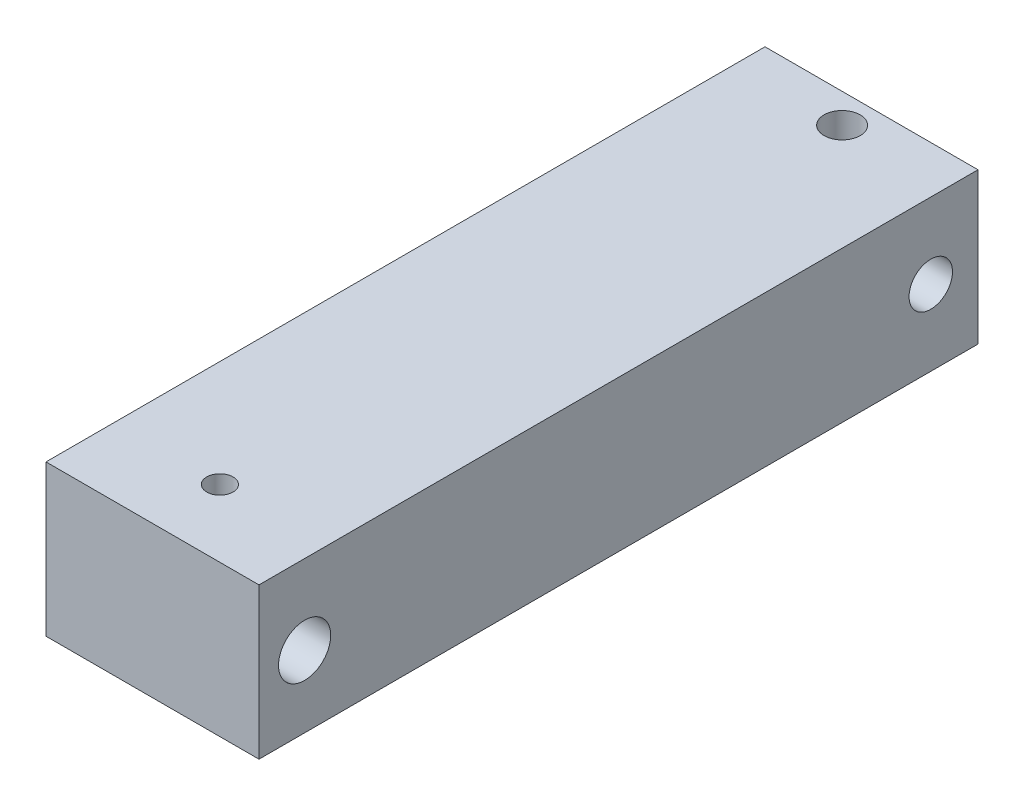
ISO-10303-21;
HEADER;
FILE_DESCRIPTION(('STEP AP214'),'2;1');
FILE_NAME('part.step','',(''),(''),'','','');
FILE_SCHEMA(('AUTOMOTIVE_DESIGN { 1 0 10303 214 1 1 1 1 }'));
ENDSEC;
DATA;
#1=APPLICATION_CONTEXT('core data for automotive mechanical design processes');
#2=APPLICATION_PROTOCOL_DEFINITION('international standard','automotive_design',2000,#1);
#3=PRODUCT_CONTEXT('',#1,'mechanical');
#4=PRODUCT('Part','Part','',(#3));
#5=PRODUCT_RELATED_PRODUCT_CATEGORY('part','',(#4));
#6=PRODUCT_DEFINITION_FORMATION('','',#4);
#7=PRODUCT_DEFINITION_CONTEXT('part definition',#1,'design');
#8=PRODUCT_DEFINITION('design','',#6,#7);
#9=PRODUCT_DEFINITION_SHAPE('','',#8);
#10=(LENGTH_UNIT() NAMED_UNIT(*) SI_UNIT(.MILLI.,.METRE.));
#11=(NAMED_UNIT(*) PLANE_ANGLE_UNIT() SI_UNIT($,.RADIAN.));
#12=(NAMED_UNIT(*) SI_UNIT($,.STERADIAN.) SOLID_ANGLE_UNIT());
#13=UNCERTAINTY_MEASURE_WITH_UNIT(LENGTH_MEASURE(1.E-05),#10,'distance_accuracy_value','');
#14=(GEOMETRIC_REPRESENTATION_CONTEXT(3) GLOBAL_UNCERTAINTY_ASSIGNED_CONTEXT((#13)) GLOBAL_UNIT_ASSIGNED_CONTEXT((#10,
#11,#12)) REPRESENTATION_CONTEXT('',''));
#15=CARTESIAN_POINT('',(0.,0.,0.));
#16=DIRECTION('',(0.,0.,1.));
#17=DIRECTION('',(1.,0.,0.));
#18=AXIS2_PLACEMENT_3D('',#15,#16,#17);
#19=CARTESIAN_POINT('',(0.,0.,117.));
#20=DIRECTION('',(1.,0.,0.));
#21=DIRECTION('',(0.,0.,-1.));
#22=AXIS2_PLACEMENT_3D('',#19,#20,#21);
#23=PLANE('',#22);
#24=CARTESIAN_POINT('',(0.,12.2852131549906,7.68541243555776));
#25=DIRECTION('',(1.,0.,0.));
#26=DIRECTION('',(0.,0.,-1.));
#27=AXIS2_PLACEMENT_3D('',#24,#25,#26);
#28=CIRCLE('',#27,3.53272884831822);
#29=CARTESIAN_POINT('',(0.,12.2852131549906,4.15268358723954));
#30=VERTEX_POINT('',#29);
#31=EDGE_CURVE('E170',#30,#30,#28,.T.);
#32=ORIENTED_EDGE('',*,*,#31,.T.);
#33=EDGE_LOOP('',(#32));
#34=FACE_BOUND('',#33,.T.);
#35=CARTESIAN_POINT('',(0.,11.6331867961656,109.575398107972));
#36=DIRECTION('',(-1.,0.,0.));
#37=DIRECTION('',(0.,0.,1.));
#38=AXIS2_PLACEMENT_3D('',#35,#36,#37);
#39=CIRCLE('',#38,4.24212622823838);
#40=CARTESIAN_POINT('',(0.,11.6331867961656,113.817524336211));
#41=VERTEX_POINT('',#40);
#42=EDGE_CURVE('E137',#41,#41,#39,.T.);
#43=ORIENTED_EDGE('',*,*,#42,.F.);
#44=EDGE_LOOP('',(#43));
#45=FACE_BOUND('',#44,.T.);
#46=DIRECTION('',(0.,-1.,0.));
#47=VECTOR('',#46,1.);
#48=CARTESIAN_POINT('',(0.,0.,0.));
#49=LINE('',#48,#47);
#50=CARTESIAN_POINT('',(0.,24.5704263099813,0.));
#51=VERTEX_POINT('',#50);
#52=CARTESIAN_POINT('',(0.,0.,0.));
#53=VERTEX_POINT('',#52);
#54=EDGE_CURVE('E114',#51,#53,#49,.T.);
#55=ORIENTED_EDGE('',*,*,#54,.T.);
#56=DIRECTION('',(0.,0.,-1.));
#57=VECTOR('',#56,1.);
#58=CARTESIAN_POINT('',(0.,0.,117.));
#59=LINE('',#58,#57);
#60=CARTESIAN_POINT('',(0.,0.,117.));
#61=VERTEX_POINT('',#60);
#62=EDGE_CURVE('E11',#61,#53,#59,.T.);
#63=ORIENTED_EDGE('',*,*,#62,.F.);
#64=DIRECTION('',(0.,-1.,0.));
#65=VECTOR('',#64,1.);
#66=CARTESIAN_POINT('',(0.,0.,117.));
#67=LINE('',#66,#65);
#68=CARTESIAN_POINT('',(0.,24.5704263099813,117.));
#69=VERTEX_POINT('',#68);
#70=EDGE_CURVE('E97',#69,#61,#67,.T.);
#71=ORIENTED_EDGE('',*,*,#70,.F.);
#72=DIRECTION('',(0.,0.,-1.));
#73=VECTOR('',#72,1.);
#74=CARTESIAN_POINT('',(0.,24.5704263099813,117.));
#75=LINE('',#74,#73);
#76=EDGE_CURVE('E110',#69,#51,#75,.T.);
#77=ORIENTED_EDGE('',*,*,#76,.T.);
#78=EDGE_LOOP('',(#55,#63,#71,#77));
#79=FACE_BOUND('',#78,.T.);
#80=ADVANCED_FACE('F38',(#34,#45,#79),#23,.F.);
#81=CARTESIAN_POINT('',(0.,0.,117.));
#82=DIRECTION('',(0.,1.,0.));
#83=DIRECTION('',(0.,0.,1.));
#84=AXIS2_PLACEMENT_3D('',#81,#82,#83);
#85=PLANE('',#84);
#86=CARTESIAN_POINT('',(17.3300915608423,0.,4.7781419650313));
#87=DIRECTION('',(0.,1.,0.));
#88=DIRECTION('',(0.,0.,1.));
#89=AXIS2_PLACEMENT_3D('',#86,#87,#88);
#90=CIRCLE('',#89,2.93650609483379);
#91=CARTESIAN_POINT('',(17.3300915608423,0.,7.71464805986509));
#92=VERTEX_POINT('',#91);
#93=EDGE_CURVE('E118',#92,#92,#90,.T.);
#94=ORIENTED_EDGE('',*,*,#93,.T.);
#95=EDGE_LOOP('',(#94));
#96=FACE_BOUND('',#95,.T.);
#97=CARTESIAN_POINT('',(17.3300915608423,0.,106.034000041412));
#98=DIRECTION('',(0.,1.,0.));
#99=DIRECTION('',(0.,0.,1.));
#100=AXIS2_PLACEMENT_3D('',#97,#98,#99);
#101=CIRCLE('',#100,2.13836371680032);
#102=CARTESIAN_POINT('',(17.3300915608423,0.,108.172363758212));
#103=VERTEX_POINT('',#102);
#104=EDGE_CURVE('E209',#103,#103,#101,.T.);
#105=ORIENTED_EDGE('',*,*,#104,.T.);
#106=EDGE_LOOP('',(#105));
#107=FACE_BOUND('',#106,.T.);
#108=DIRECTION('',(1.,0.,0.));
#109=VECTOR('',#108,1.);
#110=CARTESIAN_POINT('',(0.,0.,0.));
#111=LINE('',#110,#109);
#112=CARTESIAN_POINT('',(34.6601831216846,0.,0.));
#113=VERTEX_POINT('',#112);
#114=EDGE_CURVE('E102',#53,#113,#111,.T.);
#115=ORIENTED_EDGE('',*,*,#114,.T.);
#116=DIRECTION('',(0.,0.,-1.));
#117=VECTOR('',#116,1.);
#118=CARTESIAN_POINT('',(34.6601831216846,0.,117.));
#119=LINE('',#118,#117);
#120=CARTESIAN_POINT('',(34.6601831216846,0.,117.));
#121=VERTEX_POINT('',#120);
#122=EDGE_CURVE('E53',#121,#113,#119,.T.);
#123=ORIENTED_EDGE('',*,*,#122,.F.);
#124=DIRECTION('',(1.,0.,0.));
#125=VECTOR('',#124,1.);
#126=CARTESIAN_POINT('',(0.,0.,117.));
#127=LINE('',#126,#125);
#128=EDGE_CURVE('E92',#61,#121,#127,.T.);
#129=ORIENTED_EDGE('',*,*,#128,.F.);
#130=ORIENTED_EDGE('',*,*,#62,.T.);
#131=EDGE_LOOP('',(#115,#123,#129,#130));
#132=FACE_BOUND('',#131,.T.);
#133=ADVANCED_FACE('F101',(#96,#107,#132),#85,.F.);
#134=CARTESIAN_POINT('',(34.6601831216846,0.,117.));
#135=DIRECTION('',(-1.,0.,0.));
#136=DIRECTION('',(0.,0.,1.));
#137=AXIS2_PLACEMENT_3D('',#134,#135,#136);
#138=PLANE('',#137);
#139=CARTESIAN_POINT('',(34.6601831216846,12.2852131549906,7.68541243555776));
#140=DIRECTION('',(1.,0.,0.));
#141=DIRECTION('',(0.,0.,-1.));
#142=AXIS2_PLACEMENT_3D('',#139,#140,#141);
#143=CIRCLE('',#142,3.53272884831822);
#144=CARTESIAN_POINT('',(34.6601831216846,12.2852131549906,4.15268358723954));
#145=VERTEX_POINT('',#144);
#146=EDGE_CURVE('E193',#145,#145,#143,.T.);
#147=ORIENTED_EDGE('',*,*,#146,.F.);
#148=EDGE_LOOP('',(#147));
#149=FACE_BOUND('',#148,.T.);
#150=CARTESIAN_POINT('',(34.6601831216846,11.6331867961656,109.575398107972));
#151=DIRECTION('',(-1.,0.,0.));
#152=DIRECTION('',(0.,0.,1.));
#153=AXIS2_PLACEMENT_3D('',#150,#151,#152);
#154=CIRCLE('',#153,4.24212622823838);
#155=CARTESIAN_POINT('',(34.6601831216846,11.6331867961656,113.817524336211));
#156=VERTEX_POINT('',#155);
#157=EDGE_CURVE('E136',#156,#156,#154,.T.);
#158=ORIENTED_EDGE('',*,*,#157,.T.);
#159=EDGE_LOOP('',(#158));
#160=FACE_BOUND('',#159,.T.);
#161=DIRECTION('',(0.,1.,0.));
#162=VECTOR('',#161,1.);
#163=CARTESIAN_POINT('',(34.6601831216846,0.,0.));
#164=LINE('',#163,#162);
#165=CARTESIAN_POINT('',(34.6601831216846,24.5704263099813,0.));
#166=VERTEX_POINT('',#165);
#167=EDGE_CURVE('E79',#113,#166,#164,.T.);
#168=ORIENTED_EDGE('',*,*,#167,.T.);
#169=DIRECTION('',(0.,0.,-1.));
#170=VECTOR('',#169,1.);
#171=CARTESIAN_POINT('',(34.6601831216846,24.5704263099813,117.));
#172=LINE('',#171,#170);
#173=CARTESIAN_POINT('',(34.6601831216846,24.5704263099813,117.));
#174=VERTEX_POINT('',#173);
#175=EDGE_CURVE('E104',#174,#166,#172,.T.);
#176=ORIENTED_EDGE('',*,*,#175,.F.);
#177=DIRECTION('',(0.,1.,0.));
#178=VECTOR('',#177,1.);
#179=CARTESIAN_POINT('',(34.6601831216846,0.,117.));
#180=LINE('',#179,#178);
#181=EDGE_CURVE('E95',#121,#174,#180,.T.);
#182=ORIENTED_EDGE('',*,*,#181,.F.);
#183=ORIENTED_EDGE('',*,*,#122,.T.);
#184=EDGE_LOOP('',(#168,#176,#182,#183));
#185=FACE_BOUND('',#184,.T.);
#186=ADVANCED_FACE('F106',(#149,#160,#185),#138,.F.);
#187=CARTESIAN_POINT('',(0.,24.5704263099813,117.));
#188=DIRECTION('',(0.,-1.,0.));
#189=DIRECTION('',(0.,0.,-1.));
#190=AXIS2_PLACEMENT_3D('',#187,#188,#189);
#191=PLANE('',#190);
#192=CARTESIAN_POINT('',(17.3300915608423,24.5704263099813,4.7781419650313));
#193=DIRECTION('',(0.,1.,0.));
#194=DIRECTION('',(0.,0.,1.));
#195=AXIS2_PLACEMENT_3D('',#192,#193,#194);
#196=CIRCLE('',#195,2.93650609483379);
#197=CARTESIAN_POINT('',(17.3300915608423,24.5704263099813,7.71464805986509));
#198=VERTEX_POINT('',#197);
#199=EDGE_CURVE('E202',#198,#198,#196,.T.);
#200=ORIENTED_EDGE('',*,*,#199,.F.);
#201=EDGE_LOOP('',(#200));
#202=FACE_BOUND('',#201,.T.);
#203=CARTESIAN_POINT('',(17.3300915608423,24.5704263099813,106.034000041412));
#204=DIRECTION('',(0.,1.,0.));
#205=DIRECTION('',(0.,0.,1.));
#206=AXIS2_PLACEMENT_3D('',#203,#204,#205);
#207=CIRCLE('',#206,2.13836371680032);
#208=CARTESIAN_POINT('',(17.3300915608423,24.5704263099813,108.172363758212));
#209=VERTEX_POINT('',#208);
#210=EDGE_CURVE('E198',#209,#209,#207,.T.);
#211=ORIENTED_EDGE('',*,*,#210,.F.);
#212=EDGE_LOOP('',(#211));
#213=FACE_BOUND('',#212,.T.);
#214=DIRECTION('',(-1.,0.,0.));
#215=VECTOR('',#214,1.);
#216=CARTESIAN_POINT('',(0.,24.5704263099813,0.));
#217=LINE('',#216,#215);
#218=EDGE_CURVE('E85',#166,#51,#217,.T.);
#219=ORIENTED_EDGE('',*,*,#218,.T.);
#220=ORIENTED_EDGE('',*,*,#76,.F.);
#221=DIRECTION('',(-1.,0.,0.));
#222=VECTOR('',#221,1.);
#223=CARTESIAN_POINT('',(0.,24.5704263099813,117.));
#224=LINE('',#223,#222);
#225=EDGE_CURVE('E62',#174,#69,#224,.T.);
#226=ORIENTED_EDGE('',*,*,#225,.F.);
#227=ORIENTED_EDGE('',*,*,#175,.T.);
#228=EDGE_LOOP('',(#219,#220,#226,#227));
#229=FACE_BOUND('',#228,.T.);
#230=ADVANCED_FACE('F182',(#202,#213,#229),#191,.F.);
#231=CARTESIAN_POINT('',(0.,0.,117.));
#232=DIRECTION('',(0.,0.,-1.));
#233=DIRECTION('',(-1.,0.,0.));
#234=AXIS2_PLACEMENT_3D('',#231,#232,#233);
#235=PLANE('',#234);
#236=ORIENTED_EDGE('',*,*,#70,.T.);
#237=ORIENTED_EDGE('',*,*,#128,.T.);
#238=ORIENTED_EDGE('',*,*,#181,.T.);
#239=ORIENTED_EDGE('',*,*,#225,.T.);
#240=EDGE_LOOP('',(#236,#237,#238,#239));
#241=FACE_BOUND('',#240,.T.);
#242=ADVANCED_FACE('F93',(#241),#235,.F.);
#243=CARTESIAN_POINT('',(0.,0.,0.));
#244=DIRECTION('',(0.,0.,-1.));
#245=DIRECTION('',(-1.,0.,0.));
#246=AXIS2_PLACEMENT_3D('',#243,#244,#245);
#247=PLANE('',#246);
#248=ORIENTED_EDGE('',*,*,#54,.F.);
#249=ORIENTED_EDGE('',*,*,#218,.F.);
#250=ORIENTED_EDGE('',*,*,#167,.F.);
#251=ORIENTED_EDGE('',*,*,#114,.F.);
#252=EDGE_LOOP('',(#248,#249,#250,#251));
#253=FACE_BOUND('',#252,.T.);
#254=ADVANCED_FACE('F156',(#253),#247,.T.);
#255=CARTESIAN_POINT('',(17.3300915608423,-92.4295736900188,106.034000041412));
#256=DIRECTION('',(0.,1.,0.));
#257=DIRECTION('',(0.,0.,1.));
#258=AXIS2_PLACEMENT_3D('',#255,#256,#257);
#259=CYLINDRICAL_SURFACE('',#258,2.13836371680032);
#260=CARTESIAN_POINT('',(17.3300915608423,7.62979703875984,108.172363758212));
#261=CARTESIAN_POINT('',(17.4428519359817,7.62979645506214,108.172362716057));
#262=CARTESIAN_POINT('',(17.5556235149019,7.63289911795835,108.163415715797));
#263=CARTESIAN_POINT('',(17.778012500826,7.64559458986403,108.127954909767));
#264=CARTESIAN_POINT('',(17.887629408213,7.65518842107049,108.101438337243));
#265=CARTESIAN_POINT('',(18.1006203777589,7.68166839365231,108.031858349149));
#266=CARTESIAN_POINT('',(18.203991380786,7.69855807592724,107.988786900111));
#267=CARTESIAN_POINT('',(18.4014131357303,7.74074035739039,107.887954611246));
#268=CARTESIAN_POINT('',(18.4954662307599,7.76603083708734,107.830197477425));
#269=CARTESIAN_POINT('',(18.6708645577259,7.82586307611838,107.703292813052));
#270=CARTESIAN_POINT('',(18.7523167469285,7.86031934489737,107.634252705564));
#271=CARTESIAN_POINT('',(18.9016744575812,7.93931962175102,107.487844740483));
#272=CARTESIAN_POINT('',(18.9695812415365,7.9838626888543,107.410477660045));
#273=CARTESIAN_POINT('',(19.0916306860791,8.0836330108366,107.250474740131));
#274=CARTESIAN_POINT('',(19.1456352286634,8.13895854884632,107.167795520018));
#275=CARTESIAN_POINT('',(19.2394065197182,8.25951149708071,107.001591194326));
#276=CARTESIAN_POINT('',(19.279167404102,8.32474296985882,106.91806575488));
#277=CARTESIAN_POINT('',(19.3351627796305,8.44183189284605,106.779629840224));
#278=CARTESIAN_POINT('',(19.3548574578154,8.49133904362021,106.724072137117));
#279=CARTESIAN_POINT('',(19.3888693497764,8.59410726715672,106.614781401766));
#280=CARTESIAN_POINT('',(19.4031849449825,8.64736946409895,106.56104892315));
#281=CARTESIAN_POINT('',(19.4271040495793,8.75733436269526,106.455958306269));
#282=CARTESIAN_POINT('',(19.4367000988569,8.81404235313022,106.404604042521));
#283=CARTESIAN_POINT('',(19.4518409130174,8.9304758754905,106.304790688537));
#284=CARTESIAN_POINT('',(19.4573845348925,8.99020225369285,106.256332418668));
#285=CARTESIAN_POINT('',(19.4665604658248,9.13546134422006,106.144909340822));
#286=CARTESIAN_POINT('',(19.4686754123834,9.2222060483516,106.083395100824));
#287=CARTESIAN_POINT('',(19.4681991500111,9.40006591527638,105.967058882766));
#288=CARTESIAN_POINT('',(19.4656061091939,9.49118276584852,105.912239518552));
#289=CARTESIAN_POINT('',(19.4572717217189,9.67725824025089,105.809593897681));
#290=CARTESIAN_POINT('',(19.4515267885876,9.77222112618329,105.761775686166));
#291=CARTESIAN_POINT('',(19.4383110841407,9.96536644546947,105.673438311573));
#292=CARTESIAN_POINT('',(19.4308401717746,10.0635491413898,105.63291974552));
#293=CARTESIAN_POINT('',(19.4152187207693,10.2656843126404,105.558243438334));
#294=CARTESIAN_POINT('',(19.4070543985725,10.3697214270659,105.524317583176));
#295=CARTESIAN_POINT('',(19.3914809708211,10.5801608749788,105.464591115333));
#296=CARTESIAN_POINT('',(19.3840718731822,10.6865632332429,105.438790587806));
#297=CARTESIAN_POINT('',(19.3710317871482,10.9010070935376,105.39550640263));
#298=CARTESIAN_POINT('',(19.3653983734972,11.0090461467721,105.378011384507));
#299=CARTESIAN_POINT('',(19.3566345693287,11.2262564080606,105.351417231049));
#300=CARTESIAN_POINT('',(19.353504186568,11.3354276196222,105.342318121733));
#301=CARTESIAN_POINT('',(19.3500345851208,11.5621180160007,105.33224260319));
#302=CARTESIAN_POINT('',(19.3499137734412,11.6796695332412,105.331901734243));
#303=CARTESIAN_POINT('',(19.3530428440734,11.9143548802874,105.340971110679));
#304=CARTESIAN_POINT('',(19.3562929800967,12.0314886779879,105.350382090028));
#305=CARTESIAN_POINT('',(19.3656870759883,12.2646444689766,105.378886055216));
#306=CARTESIAN_POINT('',(19.3718357765347,12.380664322021,105.397994906113));
#307=CARTESIAN_POINT('',(19.3860987893041,12.6105963246741,105.445737785643));
#308=CARTESIAN_POINT('',(19.394213083784,12.7245084932985,105.474371728296));
#309=CARTESIAN_POINT('',(19.4109625720635,12.9473859122477,105.540331181235));
#310=CARTESIAN_POINT('',(19.4195849811863,13.0564040003559,105.577481706493));
#311=CARTESIAN_POINT('',(19.4360182251245,13.2711285609397,105.660549789536));
#312=CARTESIAN_POINT('',(19.4438289581649,13.3768346169661,105.706468444703));
#313=CARTESIAN_POINT('',(19.4569476680163,13.584156505604,105.8067665698));
#314=CARTESIAN_POINT('',(19.4622591425884,13.6857778714309,105.861134072696));
#315=CARTESIAN_POINT('',(19.4685224680823,13.884307002173,105.977985937599));
#316=CARTESIAN_POINT('',(19.4694763480063,13.9812169400428,106.040466508023));
#317=CARTESIAN_POINT('',(19.464153358198,14.2030097995986,106.1966567936));
#318=CARTESIAN_POINT('',(19.4551964607853,14.3256466483783,106.293590484348));
#319=CARTESIAN_POINT('',(19.4287378867259,14.4998796083571,106.447501171865));
#320=CARTESIAN_POINT('',(19.41775452711,14.5563171009711,106.500201261075));
#321=CARTESIAN_POINT('',(19.3907417840019,14.665631179169,106.607940746347));
#322=CARTESIAN_POINT('',(19.3747133848635,14.7185084569567,106.662979684259));
#323=CARTESIAN_POINT('',(19.3251574220276,14.8519732581362,106.809531504977));
#324=CARTESIAN_POINT('',(19.2869443566441,14.9293729180625,106.902465841962));
#325=CARTESIAN_POINT('',(19.193102491188,15.0721339896871,107.088822745994));
#326=CARTESIAN_POINT('',(19.1374819998205,15.1375011210182,107.182245059251));
#327=CARTESIAN_POINT('',(19.0074384809981,15.2556180490194,107.365070111182));
#328=CARTESIAN_POINT('',(18.9329029401303,15.308288530842,107.454444886205));
#329=CARTESIAN_POINT('',(18.7660952145176,15.4004854566375,107.622874180029));
#330=CARTESIAN_POINT('',(18.6738264021779,15.4400143958932,107.701930656308));
#331=CARTESIAN_POINT('',(18.4847615174531,15.5034841414009,107.837168742609));
#332=CARTESIAN_POINT('',(18.3894530630536,15.5286243654052,107.894879297163));
#333=CARTESIAN_POINT('',(18.1895103400515,15.5704114729821,107.995251052228));
#334=CARTESIAN_POINT('',(18.0848769432346,15.5870591495436,108.037913657723));
#335=CARTESIAN_POINT('',(17.8712775541309,15.6127604236536,108.105728631572));
#336=CARTESIAN_POINT('',(17.7624204671646,15.6219427302912,108.131176444818));
#337=CARTESIAN_POINT('',(17.5417275889731,15.6339547251455,108.164790845142));
#338=CARTESIAN_POINT('',(17.4298916879048,15.6367841787733,108.172956794059));
#339=CARTESIAN_POINT('',(17.2049584444201,15.6363427112459,108.1716959085));
#340=CARTESIAN_POINT('',(17.0918624008073,15.6329967651107,108.162052709643));
#341=CARTESIAN_POINT('',(16.8689804782641,15.6197486196115,108.125108518055));
#342=CARTESIAN_POINT('',(16.7591946602934,15.6098462995854,108.097807200347));
#343=CARTESIAN_POINT('',(16.5460617896974,15.5826617957283,108.026616338483));
#344=CARTESIAN_POINT('',(16.4427165266278,15.5653775711647,107.982722207619));
#345=CARTESIAN_POINT('',(16.2455315036821,15.522300366139,107.88025739291));
#346=CARTESIAN_POINT('',(16.151689474061,15.4965094237091,107.821690225226));
#347=CARTESIAN_POINT('',(15.9771859815592,15.435675147653,107.693465326061));
#348=CARTESIAN_POINT('',(15.8963765607753,15.4007495515367,107.62395290867));
#349=CARTESIAN_POINT('',(15.7483627129132,15.3207943100853,107.476784541678));
#350=CARTESIAN_POINT('',(15.6811569962532,15.2757656233407,107.399129365043));
#351=CARTESIAN_POINT('',(15.5604390579532,15.1749685267527,107.23862973644));
#352=CARTESIAN_POINT('',(15.5070841981507,15.1190883278109,107.155737920363));
#353=CARTESIAN_POINT('',(15.4145972766553,14.9974475378098,106.989279976763));
#354=CARTESIAN_POINT('',(15.3754711967414,14.9316828076758,106.905713580702));
#355=CARTESIAN_POINT('',(15.3203787280805,14.8134795773957,106.767038088861));
#356=CARTESIAN_POINT('',(15.3009989748042,14.7633622349449,106.711251152951));
#357=CARTESIAN_POINT('',(15.2676346543877,14.6593721521754,106.601586385974));
#358=CARTESIAN_POINT('',(15.2536517427677,14.6054982654837,106.547709145315));
#359=CARTESIAN_POINT('',(15.218763087693,14.4386342437438,106.389727260177));
#360=CARTESIAN_POINT('',(15.2049608896919,14.3205022903404,106.289391345053));
#361=CARTESIAN_POINT('',(15.1929545646951,14.1120104665921,106.131190840964));
#362=CARTESIAN_POINT('',(15.1912403234516,14.024400862618,106.069805519048));
#363=CARTESIAN_POINT('',(15.1924457241354,13.8447743375917,105.953806323849));
#364=CARTESIAN_POINT('',(15.1953671662422,13.7527557178412,105.899195090034));
#365=CARTESIAN_POINT('',(15.204273179633,13.564887818632,105.797088960452));
#366=CARTESIAN_POINT('',(15.2102611656754,13.4690343788277,105.749602074402));
#367=CARTESIAN_POINT('',(15.2238618563948,13.2741109397894,105.662034102602));
#368=CARTESIAN_POINT('',(15.231474684755,13.1750406961788,105.621953581058));
#369=CARTESIAN_POINT('',(15.2472663929373,12.9711863412131,105.548304178742));
#370=CARTESIAN_POINT('',(15.2554553835645,12.8663199400558,105.514965173576));
#371=CARTESIAN_POINT('',(15.2709580761881,12.6542504768592,105.456519554152));
#372=CARTESIAN_POINT('',(15.2782717697823,12.5470473924015,105.431413018915));
#373=CARTESIAN_POINT('',(15.2910090496837,12.3310513982574,105.389624397493));
#374=CARTESIAN_POINT('',(15.2964352700876,12.2222609267509,105.372930556094));
#375=CARTESIAN_POINT('',(15.3046939647645,12.0036116427153,105.348043511186));
#376=CARTESIAN_POINT('',(15.307526443173,11.89375283189,105.339850294123));
#377=CARTESIAN_POINT('',(15.3103103470639,11.666598322856,105.331785177472));
#378=CARTESIAN_POINT('',(15.3100644496747,11.5492793870976,105.332483254241));
#379=CARTESIAN_POINT('',(15.3062432443874,11.315152636834,105.343586846887));
#380=CARTESIAN_POINT('',(15.3026676909694,11.1983448606584,105.353993078618));
#381=CARTESIAN_POINT('',(15.2927098335653,10.9659138164857,105.384438279358));
#382=CARTESIAN_POINT('',(15.2863227104535,10.8502929325948,105.404493793075));
#383=CARTESIAN_POINT('',(15.2717057034828,10.621226240487,105.454074895906));
#384=CARTESIAN_POINT('',(15.2634758343117,10.5077804149413,105.483600409538));
#385=CARTESIAN_POINT('',(15.2466097092132,10.2854566943173,105.551400169215));
#386=CARTESIAN_POINT('',(15.2379815030905,10.1765356263895,105.589535034828));
#387=CARTESIAN_POINT('',(15.2217048716977,9.96208095035436,105.674584073647));
#388=CARTESIAN_POINT('',(15.2140565775366,9.85654779695169,105.721499419591));
#389=CARTESIAN_POINT('',(15.2014630959888,9.64967185448291,105.823786810066));
#390=CARTESIAN_POINT('',(15.1965137453334,9.54832283567857,105.879145660236));
#391=CARTESIAN_POINT('',(15.1912042560534,9.35044081524184,105.997963517616));
#392=CARTESIAN_POINT('',(15.1908418588726,9.25390546674628,106.061418522837));
#393=CARTESIAN_POINT('',(15.197816428124,9.03476791217578,106.218678920265));
#394=CARTESIAN_POINT('',(15.2077873652,8.91433541316008,106.31550879438));
#395=CARTESIAN_POINT('',(15.2357762065731,8.74334731189933,106.468896413411));
#396=CARTESIAN_POINT('',(15.2472712587644,8.68798001322013,106.521361920849));
#397=CARTESIAN_POINT('',(15.2752845072911,8.58077772380942,106.628505717114));
#398=CARTESIAN_POINT('',(15.2918017621759,8.52894207327061,106.683183589552));
#399=CARTESIAN_POINT('',(15.3427533499809,8.39768753055037,106.829141793712));
#400=CARTESIAN_POINT('',(15.3819183426927,8.32148298748973,106.921764429461));
#401=CARTESIAN_POINT('',(15.4775947513863,8.18107661543143,107.107180553303));
#402=CARTESIAN_POINT('',(15.5340980523725,8.11686919389075,107.199973941326));
#403=CARTESIAN_POINT('',(15.6657029927552,8.00098749334833,107.381222041602));
#404=CARTESIAN_POINT('',(15.7409115028922,7.94938873363884,107.469648195727));
#405=CARTESIAN_POINT('',(15.9087665548572,7.85915329433942,107.635991893061));
#406=CARTESIAN_POINT('',(16.0014108138781,7.82051491972807,107.713910809659));
#407=CARTESIAN_POINT('',(16.1912038964246,7.75842876471537,107.847175547869));
#408=CARTESIAN_POINT('',(16.2869420416849,7.73383750997647,107.904009514466));
#409=CARTESIAN_POINT('',(16.4875401853394,7.69305519912954,108.002548850009));
#410=CARTESIAN_POINT('',(16.5923980420684,7.67686217697418,108.044257759081));
#411=CARTESIAN_POINT('',(16.801673610534,7.65251618500438,108.108764170313));
#412=CARTESIAN_POINT('',(16.9057413551858,7.6439396660934,108.132544929383));
#413=CARTESIAN_POINT('',(17.1165665301461,7.63258030164156,108.164345400799));
#414=CARTESIAN_POINT('',(17.2233240232244,7.62979759143596,108.17236474498));
#415=CARTESIAN_POINT('',(17.3300915608423,7.62979703875984,108.172363758212));
#416=B_SPLINE_CURVE_WITH_KNOTS('',3,(#260,#261,#262,#263,#264,#265,#266,#267,#268,#269,#270,
#271,#272,#273,#274,#275,#276,#277,#278,#279,#280,#281,#282,#283,#284,#285,#286,#287,#288,#289,
#290,#291,#292,#293,#294,#295,#296,#297,#298,#299,#300,#301,#302,#303,#304,#305,#306,#307,#308,
#309,#310,#311,#312,#313,#314,#315,#316,#317,#318,#319,#320,#321,#322,#323,#324,#325,#326,#327,
#328,#329,#330,#331,#332,#333,#334,#335,#336,#337,#338,#339,#340,#341,#342,#343,#344,#345,#346,
#347,#348,#349,#350,#351,#352,#353,#354,#355,#356,#357,#358,#359,#360,#361,#362,#363,#364,#365,
#366,#367,#368,#369,#370,#371,#372,#373,#374,#375,#376,#377,#378,#379,#380,#381,#382,#383,#384,
#385,#386,#387,#388,#389,#390,#391,#392,#393,#394,#395,#396,#397,#398,#399,#400,#401,#402,#403,
#404,#405,#406,#407,#408,#409,#410,#411,#412,#413,#414,#415),.UNSPECIFIED.,.T.,.F.,(4,2,2,2,2,2,
2,2,2,2,2,2,2,2,2,2,2,2,2,2,2,2,2,2,2,2,2,2,2,2,2,2,2,2,2,2,2,2,2,2,2,2,2,2,2,2,2,2,2,2,2,2,2,2,
2,2,2,2,2,2,2,2,2,2,2,2,2,2,2,2,2,2,2,2,2,2,2,4),(0.,0.337904953504927,0.675863130994551,
1.01398551452788,1.35202265569988,1.68701117651357,2.02196845997707,2.36013520030517,
2.69844100366066,2.92908412492846,3.15979659141677,3.39087257875168,3.62201371712947,
3.94063189335123,4.2593740710423,4.57847969341652,4.8976114029941,5.22648343695255,
5.55535891756695,5.88378324900748,6.21220859823815,6.56440364323838,6.9166251978126,
7.26942482924008,7.62222127610997,7.96833232766592,8.31448672538407,8.66015522168397,
9.00566274989937,9.47351516100264,9.70726221636836,9.94096369284032,10.3198201278232,
10.6984960066428,11.0794794595281,11.4603905308715,11.801385807591,12.1423492381552,
12.477301490484,12.812266111238,13.1513270336926,13.4903941963274,13.8295551550521,
14.1686349168367,14.5035429279901,14.8384191761926,15.1769481828845,15.5156193430941,
15.7476884829553,15.9798287552335,16.44458814429,16.7651992603248,17.0859349100557,
17.4070284949781,17.7281465303244,18.0588423825134,18.3895414088281,18.7197770529506,
19.0500121705208,19.4015180673972,19.7530498854512,20.1051866014827,20.4573205108626,
20.8041173872302,21.1509606155438,21.4972672946638,21.8434034502335,22.3061059195175,
22.5372868209393,22.7684244124085,23.1452902411004,23.5219799504262,23.9008733816013,
24.2797172399342,24.6201243651792,24.9604517642497,25.2803907242298,25.6003371574519),.UNSPECIFIED.);
#417=CARTESIAN_POINT('',(17.3300915608423,7.62979703875984,108.172363758212));
#418=VERTEX_POINT('',#417);
#419=EDGE_CURVE('E128',#418,#418,#416,.T.);
#420=ORIENTED_EDGE('',*,*,#419,.T.);
#421=EDGE_LOOP('',(#420));
#422=FACE_BOUND('',#421,.T.);
#423=ORIENTED_EDGE('',*,*,#210,.T.);
#424=EDGE_LOOP('',(#423));
#425=FACE_BOUND('',#424,.T.);
#426=ORIENTED_EDGE('',*,*,#104,.F.);
#427=EDGE_LOOP('',(#426));
#428=FACE_BOUND('',#427,.T.);
#429=ADVANCED_FACE('F138',(#422,#425,#428),#259,.F.);
#430=CARTESIAN_POINT('',(17.3300915608423,-92.4295736900188,4.7781419650313));
#431=DIRECTION('',(0.,1.,0.));
#432=DIRECTION('',(0.,0.,1.));
#433=AXIS2_PLACEMENT_3D('',#430,#431,#432);
#434=CYLINDRICAL_SURFACE('',#433,2.93650609483379);
#435=CARTESIAN_POINT('',(17.3300915608423,8.75260528062769,7.71464805986509));
#436=CARTESIAN_POINT('',(17.41214573999,8.75260644580014,7.71464897490024));
#437=CARTESIAN_POINT('',(17.4941857774189,8.75257080369901,7.71120624826408));
#438=CARTESIAN_POINT('',(17.6576982233216,8.75249920310425,7.69747056232914));
#439=CARTESIAN_POINT('',(17.739170495096,8.75246324453883,7.68717600724597));
#440=CARTESIAN_POINT('',(17.9820010213793,8.75258694869309,7.64606918528518));
#441=CARTESIAN_POINT('',(18.1417418189574,8.75297829162574,7.60503378992736));
#442=CARTESIAN_POINT('',(18.4521856080357,8.75711334930275,7.49678033400629));
#443=CARTESIAN_POINT('',(18.6028835199905,8.7608589297157,7.4295477139787));
#444=CARTESIAN_POINT('',(18.8185959050313,8.77218353987077,7.31076797170503));
#445=CARTESIAN_POINT('',(18.8888064165006,8.77691280955097,7.26816341347546));
#446=CARTESIAN_POINT('',(19.025256063247,8.78890882234662,7.17734758387932));
#447=CARTESIAN_POINT('',(19.0914971313032,8.79617431857901,7.12913907533222));
#448=CARTESIAN_POINT('',(19.217774315899,8.81365438626666,7.02893049369384));
#449=CARTESIAN_POINT('',(19.277928111042,8.82378599495989,6.97706419986796));
#450=CARTESIAN_POINT('',(19.3934429343563,8.84765852104092,6.86904998611382));
#451=CARTESIAN_POINT('',(19.4488063664111,8.86139761400312,6.81290424060526));
#452=CARTESIAN_POINT('',(19.5542830129194,8.89303138753873,6.69704095726647));
#453=CARTESIAN_POINT('',(19.6044000386161,8.91092302067862,6.63732606248128));
#454=CARTESIAN_POINT('',(19.6990544516905,8.9513411526283,6.51510902929595));
#455=CARTESIAN_POINT('',(19.7435924940343,8.97386710655227,6.45260721924678));
#456=CARTESIAN_POINT('',(19.8226176235943,9.02136746568121,6.33217943299404));
#457=CARTESIAN_POINT('',(19.8576658708155,9.04586245716728,6.27443156575425));
#458=CARTESIAN_POINT('',(19.9229901029207,9.09903980002299,6.15813989375486));
#459=CARTESIAN_POINT('',(19.9532645504169,9.12772349464688,6.09959583915218));
#460=CARTESIAN_POINT('',(20.0090480473374,9.18931061756556,5.98249394261334));
#461=CARTESIAN_POINT('',(20.0345591534818,9.2222122142523,5.92393611760957));
#462=CARTESIAN_POINT('',(20.0809920516508,9.29218828281417,5.80748717817805));
#463=CARTESIAN_POINT('',(20.1019120678498,9.3292643610112,5.74959632991031));
#464=CARTESIAN_POINT('',(20.1566152839527,9.44339596147433,5.58259258307256));
#465=CARTESIAN_POINT('',(20.1845862246335,9.52591775934725,5.47522415407052));
#466=CARTESIAN_POINT('',(20.2271357312888,9.70422287757139,5.2693666715591));
#467=CARTESIAN_POINT('',(20.2417093786811,9.80001105360287,5.17088089111721));
#468=CARTESIAN_POINT('',(20.2618912656217,10.0149772948275,4.97435672747248));
#469=CARTESIAN_POINT('',(20.2662335008878,10.1355819218831,4.87775232482346));
#470=CARTESIAN_POINT('',(20.2669183863336,10.3883718617141,4.70111668796782));
#471=CARTESIAN_POINT('',(20.2632548170898,10.5205661014699,4.62109839178462));
#472=CARTESIAN_POINT('',(20.2511510083134,10.8201811941147,4.46556394070832));
#473=CARTESIAN_POINT('',(20.2419372323139,10.9895307257078,4.39377356685623));
#474=CARTESIAN_POINT('',(20.2286107827503,11.2502256913264,4.30644558424385));
#475=CARTESIAN_POINT('',(20.2242485771727,11.3382896599934,4.28072003845421));
#476=CARTESIAN_POINT('',(20.2162434684493,11.5161747469794,4.23618863683257));
#477=CARTESIAN_POINT('',(20.2126003217394,11.6059952589413,4.21738043604378));
#478=CARTESIAN_POINT('',(20.2062303053904,11.7943775718158,4.18553759287051));
#479=CARTESIAN_POINT('',(20.2036046237132,11.8930459666533,4.1731119555312));
#480=CARTESIAN_POINT('',(20.2000829016757,12.0911164832102,4.15662016309375));
#481=CARTESIAN_POINT('',(20.1991869574449,12.1905186454003,4.15255447259537));
#482=CARTESIAN_POINT('',(20.1992445975445,12.3893040318024,4.15281895001042));
#483=CARTESIAN_POINT('',(20.2001980494534,12.4886872568608,4.15714851680166));
#484=CARTESIAN_POINT('',(20.2038270602193,12.6867008411998,4.17416545525802));
#485=CARTESIAN_POINT('',(20.2065025849749,12.7853312153495,4.18685266142041));
#486=CARTESIAN_POINT('',(20.2131405647371,12.9790815140675,4.22013037149488));
#487=CARTESIAN_POINT('',(20.2170750161839,13.0742317512374,4.24055052827996));
#488=CARTESIAN_POINT('',(20.2257052412574,13.262523048011,4.28916506639298));
#489=CARTESIAN_POINT('',(20.2304012738946,13.3556634118118,4.31736209489503));
#490=CARTESIAN_POINT('',(20.239848200943,13.5393755032332,4.38136650098558));
#491=CARTESIAN_POINT('',(20.2445991376495,13.6299450350094,4.4171801749394));
#492=CARTESIAN_POINT('',(20.2532990841266,13.807850387821,4.49617717139196));
#493=CARTESIAN_POINT('',(20.2572481133239,13.8951862871506,4.53936031531568));
#494=CARTESIAN_POINT('',(20.2634471320433,14.0680964188604,4.63394704478041));
#495=CARTESIAN_POINT('',(20.265654122166,14.1535782302389,4.68552287748868));
#496=CARTESIAN_POINT('',(20.2670616964522,14.3198543276552,4.79571502219885));
#497=CARTESIAN_POINT('',(20.2662637659151,14.4006509095017,4.85432784202784));
#498=CARTESIAN_POINT('',(20.2604399056761,14.556792121047,4.97801557581804));
#499=CARTESIAN_POINT('',(20.2554207901772,14.6321453251605,5.04307992592889));
#500=CARTESIAN_POINT('',(20.2399147060391,14.7767723974749,5.17898846391116));
#501=CARTESIAN_POINT('',(20.2294301060849,14.8460488840798,5.24983013673979));
#502=CARTESIAN_POINT('',(20.1955628878534,15.007242591759,5.42909609170604));
#503=CARTESIAN_POINT('',(20.1685152503313,15.0954987706053,5.54020465883886));
#504=CARTESIAN_POINT('',(20.0971882027666,15.255806674231,5.76833896916294));
#505=CARTESIAN_POINT('',(20.0529240714533,15.3278726777249,5.88535938600284));
#506=CARTESIAN_POINT('',(19.9451181810743,15.455160190352,6.12031877202227));
#507=CARTESIAN_POINT('',(19.8815144194429,15.5103263597669,6.23825948894298));
#508=CARTESIAN_POINT('',(19.7350572690598,15.6041265236793,6.46865684638118));
#509=CARTESIAN_POINT('',(19.6521987871354,15.6427561363031,6.58111202634971));
#510=CARTESIAN_POINT('',(19.4734009515864,15.7042166210026,6.78992883976425));
#511=CARTESIAN_POINT('',(19.3782880263717,15.7277212101966,6.8868057735013));
#512=CARTESIAN_POINT('',(19.174464674378,15.7646546799947,7.06722465473753));
#513=CARTESIAN_POINT('',(19.0657503835661,15.778080689742,7.15076279738638));
#514=CARTESIAN_POINT('',(18.8284763589151,15.7986781626426,7.30790275472886));
#515=CARTESIAN_POINT('',(18.6990327321045,15.8052874509842,7.38024151101973));
#516=CARTESIAN_POINT('',(18.4305996419386,15.8138667111296,7.50465317514654));
#517=CARTESIAN_POINT('',(18.2916064338783,15.8158348521777,7.55671807896093));
#518=CARTESIAN_POINT('',(17.994589380487,15.8179786794726,7.64301581429226));
#519=CARTESIAN_POINT('',(17.8359756568011,15.8179781781566,7.67523565337872));
#520=CARTESIAN_POINT('',(17.5156123767212,15.8178838300298,7.7132203790278));
#521=CARTESIAN_POINT('',(17.353862453606,15.8177899722373,7.71898215283792));
#522=CARTESIAN_POINT('',(17.0278696148788,15.8179036666773,7.70371041603279));
#523=CARTESIAN_POINT('',(16.8636552370748,15.8181182201655,7.68205586874765));
#524=CARTESIAN_POINT('',(16.5411686210372,15.8173433152118,7.611504881854));
#525=CARTESIAN_POINT('',(16.3828980357421,15.8163535243665,7.5626009233323));
#526=CARTESIAN_POINT('',(16.0768302587396,15.8098707095427,7.43888922685364));
#527=CARTESIAN_POINT('',(15.9290295823002,15.8043791916112,7.36409015690776));
#528=CARTESIAN_POINT('',(15.718756070968,15.7893090675394,7.23445800679463));
#529=CARTESIAN_POINT('',(15.6505410566883,15.7831425227615,7.18831673650752));
#530=CARTESIAN_POINT('',(15.5184424981537,15.7678678085327,7.09065687007606));
#531=CARTESIAN_POINT('',(15.454556724099,15.7587611675438,7.03914107737253));
#532=CARTESIAN_POINT('',(15.3342430308404,15.7374089274717,6.93355253279529));
#533=CARTESIAN_POINT('',(15.2776145169629,15.7253113394902,6.87967824238856));
#534=CARTESIAN_POINT('',(15.1693024239328,15.6972638068544,6.76814088538061));
#535=CARTESIAN_POINT('',(15.1176163188473,15.6813158448727,6.71047977981237));
#536=CARTESIAN_POINT('',(15.019589234345,15.6450835688521,6.59212849520376));
#537=CARTESIAN_POINT('',(14.9732444047434,15.624802408818,6.53144054381152));
#538=CARTESIAN_POINT('',(14.8861570553966,15.5795034315667,6.4078550059012));
#539=CARTESIAN_POINT('',(14.8454139402638,15.5544861184122,6.34495765510642));
#540=CARTESIAN_POINT('',(14.7736216793964,15.5023132656111,6.22449110275184));
#541=CARTESIAN_POINT('',(14.7420053657749,15.4756487367152,6.16704601221506));
#542=CARTESIAN_POINT('',(14.6833978734631,15.4182147542405,6.05182158095797));
#543=CARTESIAN_POINT('',(14.6564081759586,15.3874439916597,5.99404213929415));
#544=CARTESIAN_POINT('',(14.6069749581158,15.3218244942356,5.8788820464747));
#545=CARTESIAN_POINT('',(14.5845300673907,15.2869769936585,5.82150128016186));
#546=CARTESIAN_POINT('',(14.5439619024071,15.2133001930154,5.7077664778987));
#547=CARTESIAN_POINT('',(14.5258403188313,15.1744693436723,5.65141285155482));
#548=CARTESIAN_POINT('',(14.4781415651653,15.0537504477714,5.48687261323558));
#549=CARTESIAN_POINT('',(14.4543094794545,14.9663701884064,5.38096234034708));
#550=CARTESIAN_POINT('',(14.4192752304563,14.7787213612038,5.17909001762106));
#551=CARTESIAN_POINT('',(14.4080780011371,14.6784477754792,5.08313186740595));
#552=CARTESIAN_POINT('',(14.3939655270344,14.4523689870903,4.89103703463761));
#553=CARTESIAN_POINT('',(14.3924074976988,14.3249502324295,4.79670559774346));
#554=CARTESIAN_POINT('',(14.3962834964631,14.0586319692063,4.6259653871214));
#555=CARTESIAN_POINT('',(14.4017232869459,13.9197230872272,4.54957144537954));
#556=CARTESIAN_POINT('',(14.4124696359003,13.6915136209164,4.44330068486433));
#557=CARTESIAN_POINT('',(14.4169294195652,13.6050311639108,4.40714562830434));
#558=CARTESIAN_POINT('',(14.4259936664946,13.4294798659467,4.34182308613968));
#559=CARTESIAN_POINT('',(14.430598096104,13.3404116269892,4.31265398851754));
#560=CARTESIAN_POINT('',(14.4392797852249,13.1601842751886,4.26147037341855));
#561=CARTESIAN_POINT('',(14.4433568477659,13.0690243960035,4.23945852453948));
#562=CARTESIAN_POINT('',(14.4504485175646,12.8852351635384,4.20275191062987));
#563=CARTESIAN_POINT('',(14.4534635077017,12.792606352422,4.18805450793553));
#564=CARTESIAN_POINT('',(14.4581949535863,12.6009813548129,4.16542558287638));
#565=CARTESIAN_POINT('',(14.4598250431296,12.5019299031325,4.15794059379396));
#566=CARTESIAN_POINT('',(14.4612599611782,12.3035315224779,4.15133692865718));
#567=CARTESIAN_POINT('',(14.4610647064172,12.2041845802309,4.15221863426429));
#568=CARTESIAN_POINT('',(14.4588749671347,12.0059305945274,4.16234176130451));
#569=CARTESIAN_POINT('',(14.4568803452472,11.9070235852351,4.17158382097775));
#570=CARTESIAN_POINT('',(14.4513595770894,11.710383160138,4.19835209426724));
#571=CARTESIAN_POINT('',(14.4478334469833,11.6126497319577,4.21587822044957));
#572=CARTESIAN_POINT('',(14.4398176300781,11.4208633796231,4.25867275011147));
#573=CARTESIAN_POINT('',(14.4353472476027,11.3267758054556,4.28378983984185));
#574=CARTESIAN_POINT('',(14.4260510418472,11.1409790118676,4.34170590230459));
#575=CARTESIAN_POINT('',(14.4212250987731,11.0492706082287,4.37450747224966));
#576=CARTESIAN_POINT('',(14.4120147255516,10.8687809636197,4.44760754749841));
#577=CARTESIAN_POINT('',(14.4076306550623,10.7800021460606,4.48791208501504));
#578=CARTESIAN_POINT('',(14.4002373993236,10.6060348028279,4.57574568351242));
#579=CARTESIAN_POINT('',(14.3972281414458,10.5208460877123,4.62327436267985));
#580=CARTESIAN_POINT('',(14.3935791735519,10.3528182022742,4.72636727576647));
#581=CARTESIAN_POINT('',(14.3929930012319,10.2700718342758,4.78208517195686));
#582=CARTESIAN_POINT('',(14.3955311102783,10.1096569146635,4.90026482286826));
#583=CARTESIAN_POINT('',(14.3986533816478,10.0319856363871,4.96272290769491));
#584=CARTESIAN_POINT('',(14.4098498581818,9.88252326400283,5.09367578488312));
#585=CARTESIAN_POINT('',(14.4179145491227,9.81072117189061,5.16215876284191));
#586=CARTESIAN_POINT('',(14.4402204098187,9.67360877194483,5.30435002879553));
#587=CARTESIAN_POINT('',(14.4544586329725,9.60829538533603,5.37805580994539));
#588=CARTESIAN_POINT('',(14.4978570733653,9.45880275068404,5.56154791447293));
#589=CARTESIAN_POINT('',(14.530774731069,9.3782433997554,5.67347036882257));
#590=CARTESIAN_POINT('',(14.6140856628091,9.23322680269246,5.90110180246064));
#591=CARTESIAN_POINT('',(14.6644661903713,9.16875787073671,6.01680796431377));
#592=CARTESIAN_POINT('',(14.7839552465291,9.05610814991454,6.2468385775356));
#593=CARTESIAN_POINT('',(14.8530999545407,9.00795923543771,6.36115990928792));
#594=CARTESIAN_POINT('',(15.0094736373845,8.92694095826645,6.58263269013524));
#595=CARTESIAN_POINT('',(15.09670875276,8.89407679608861,6.68978168830053));
#596=CARTESIAN_POINT('',(15.2849745876029,8.84172774815412,6.88977476331482));
#597=CARTESIAN_POINT('',(15.3856274533797,8.82194298217342,6.98289865758199));
#598=CARTESIAN_POINT('',(15.5998169641302,8.79148119297162,7.15471342668877));
#599=CARTESIAN_POINT('',(15.7133602171617,8.78080886520481,7.2333968442713));
#600=CARTESIAN_POINT('',(15.9614009532642,8.76481624477425,7.38052332139829));
#601=CARTESIAN_POINT('',(16.0968648161551,8.76006718252277,7.44739699908914));
#602=CARTESIAN_POINT('',(16.3764358193723,8.75427726192153,7.55955819095421));
#603=CARTESIAN_POINT('',(16.5205379950662,8.753234293984,7.60485797272737));
#604=CARTESIAN_POINT('',(16.7757751243473,8.75246315876471,7.66401226300884));
#605=CARTESIAN_POINT('',(16.8857573898326,8.75246396407811,7.68297704273951));
#606=CARTESIAN_POINT('',(17.1071989540015,8.75253423277316,7.70829451422794));
#607=CARTESIAN_POINT('',(17.2186582981094,8.75260369827115,7.71464681720623));
#608=CARTESIAN_POINT('',(17.3300915608423,8.75260528062769,7.71464805986509));
#609=B_SPLINE_CURVE_WITH_KNOTS('',3,(#435,#436,#437,#438,#439,#440,#441,#442,#443,#444,#445,
#446,#447,#448,#449,#450,#451,#452,#453,#454,#455,#456,#457,#458,#459,#460,#461,#462,#463,#464,
#465,#466,#467,#468,#469,#470,#471,#472,#473,#474,#475,#476,#477,#478,#479,#480,#481,#482,#483,
#484,#485,#486,#487,#488,#489,#490,#491,#492,#493,#494,#495,#496,#497,#498,#499,#500,#501,#502,
#503,#504,#505,#506,#507,#508,#509,#510,#511,#512,#513,#514,#515,#516,#517,#518,#519,#520,#521,
#522,#523,#524,#525,#526,#527,#528,#529,#530,#531,#532,#533,#534,#535,#536,#537,#538,#539,#540,
#541,#542,#543,#544,#545,#546,#547,#548,#549,#550,#551,#552,#553,#554,#555,#556,#557,#558,#559,
#560,#561,#562,#563,#564,#565,#566,#567,#568,#569,#570,#571,#572,#573,#574,#575,#576,#577,#578,
#579,#580,#581,#582,#583,#584,#585,#586,#587,#588,#589,#590,#591,#592,#593,#594,#595,#596,#597,
#598,#599,#600,#601,#602,#603,#604,#605,#606,#607,#608),.UNSPECIFIED.,.T.,.F.,(4,2,2,2,2,2,2,2,
2,2,2,2,2,2,2,2,2,2,2,2,2,2,2,2,2,2,2,2,2,2,2,2,2,2,2,2,2,2,2,2,2,2,2,2,2,2,2,2,2,2,2,2,2,2,2,2,
2,2,2,2,2,2,2,2,2,2,2,2,2,2,2,2,2,2,2,2,2,2,2,2,2,2,2,2,2,2,4),(0.,0.246056972691596,
0.492171271881716,0.984492191176256,1.47708711568377,1.7236029880576,1.96999783631827,
2.2098846508234,2.44965037942401,2.68924070392011,2.92880287437886,3.14408949754671,
3.3594453121358,3.57470792405564,3.79005365299823,4.20300970873093,4.61611731358919,
5.07814346114527,5.54052866790563,6.09052456296269,6.36584721263409,6.64107644263324,
6.93915681449488,7.23725375157214,7.53532934492368,7.83339903579041,8.12525227848973,
8.4172049881613,8.70939998772193,9.00158790789699,9.30078026271949,9.59982474944492,
9.89838741715771,10.1968207983252,10.6281922598853,11.0591817723128,11.4915678659434,
11.924068462867,12.3356521585026,12.7473530482298,13.1908029783802,13.6344278034052,
14.1177565448146,14.6011421476837,15.0956759356392,15.590346247619,16.0848511357699,
16.3323288427892,16.5796781006655,16.8166316733156,17.0534634907457,17.2901235091074,
17.5267583541821,17.7388461495428,17.9510017173598,18.1630932187441,18.3752675256752,
18.7915068122634,19.2079085859763,19.6818126694845,20.1561072411183,20.437374482085,
20.7185767576682,20.9998837603029,21.2810892471293,21.5787595400618,21.876443411813,
22.1741500110502,22.4718534682224,22.7639755341919,23.0561964748403,23.3486533770724,
23.6410948276222,23.9399642815322,24.2386718204477,24.5368061417241,24.8347983211028,
25.2581314261275,25.6811561808688,26.1050024414961,26.528992807166,26.9428897252002,
27.3569997874212,27.808556230971,28.2598555977698,28.594001724401,28.928158150923),.UNSPECIFIED.);
#610=CARTESIAN_POINT('',(17.3300915608423,8.75260528062769,7.71464805986509));
#611=VERTEX_POINT('',#610);
#612=EDGE_CURVE('E41',#611,#611,#609,.T.);
#613=ORIENTED_EDGE('',*,*,#612,.T.);
#614=EDGE_LOOP('',(#613));
#615=FACE_BOUND('',#614,.T.);
#616=ORIENTED_EDGE('',*,*,#199,.T.);
#617=EDGE_LOOP('',(#616));
#618=FACE_BOUND('',#617,.T.);
#619=ORIENTED_EDGE('',*,*,#93,.F.);
#620=EDGE_LOOP('',(#619));
#621=FACE_BOUND('',#620,.T.);
#622=ADVANCED_FACE('F145',(#615,#618,#621),#434,.F.);
#623=CARTESIAN_POINT('',(117.,11.6331867961656,109.575398107972));
#624=DIRECTION('',(-1.,0.,0.));
#625=DIRECTION('',(0.,0.,1.));
#626=AXIS2_PLACEMENT_3D('',#623,#624,#625);
#627=CYLINDRICAL_SURFACE('',#626,4.24212622823838);
#628=ORIENTED_EDGE('',*,*,#419,.F.);
#629=EDGE_LOOP('',(#628));
#630=FACE_BOUND('',#629,.T.);
#631=ORIENTED_EDGE('',*,*,#42,.T.);
#632=EDGE_LOOP('',(#631));
#633=FACE_BOUND('',#632,.T.);
#634=ORIENTED_EDGE('',*,*,#157,.F.);
#635=EDGE_LOOP('',(#634));
#636=FACE_BOUND('',#635,.T.);
#637=ADVANCED_FACE('F141',(#630,#633,#636),#627,.F.);
#638=CARTESIAN_POINT('',(-15.3398168783154,12.2852131549906,7.68541243555776));
#639=DIRECTION('',(1.,0.,0.));
#640=DIRECTION('',(0.,0.,-1.));
#641=AXIS2_PLACEMENT_3D('',#638,#639,#640);
#642=CYLINDRICAL_SURFACE('',#641,3.53272884831822);
#643=ORIENTED_EDGE('',*,*,#612,.F.);
#644=EDGE_LOOP('',(#643));
#645=FACE_BOUND('',#644,.T.);
#646=ORIENTED_EDGE('',*,*,#146,.T.);
#647=EDGE_LOOP('',(#646));
#648=FACE_BOUND('',#647,.T.);
#649=ORIENTED_EDGE('',*,*,#31,.F.);
#650=EDGE_LOOP('',(#649));
#651=FACE_BOUND('',#650,.T.);
#652=ADVANCED_FACE('F144',(#645,#648,#651),#642,.F.);
#653=CLOSED_SHELL('',(#80,#133,#186,#230,#242,#254,#429,#622,#637,#652));
#654=MANIFOLD_SOLID_BREP('B2',#653);
#655=ADVANCED_BREP_SHAPE_REPRESENTATION('',(#18,#654),#14);
#656=SHAPE_DEFINITION_REPRESENTATION(#9,#655);
ENDSEC;
END-ISO-10303-21;
